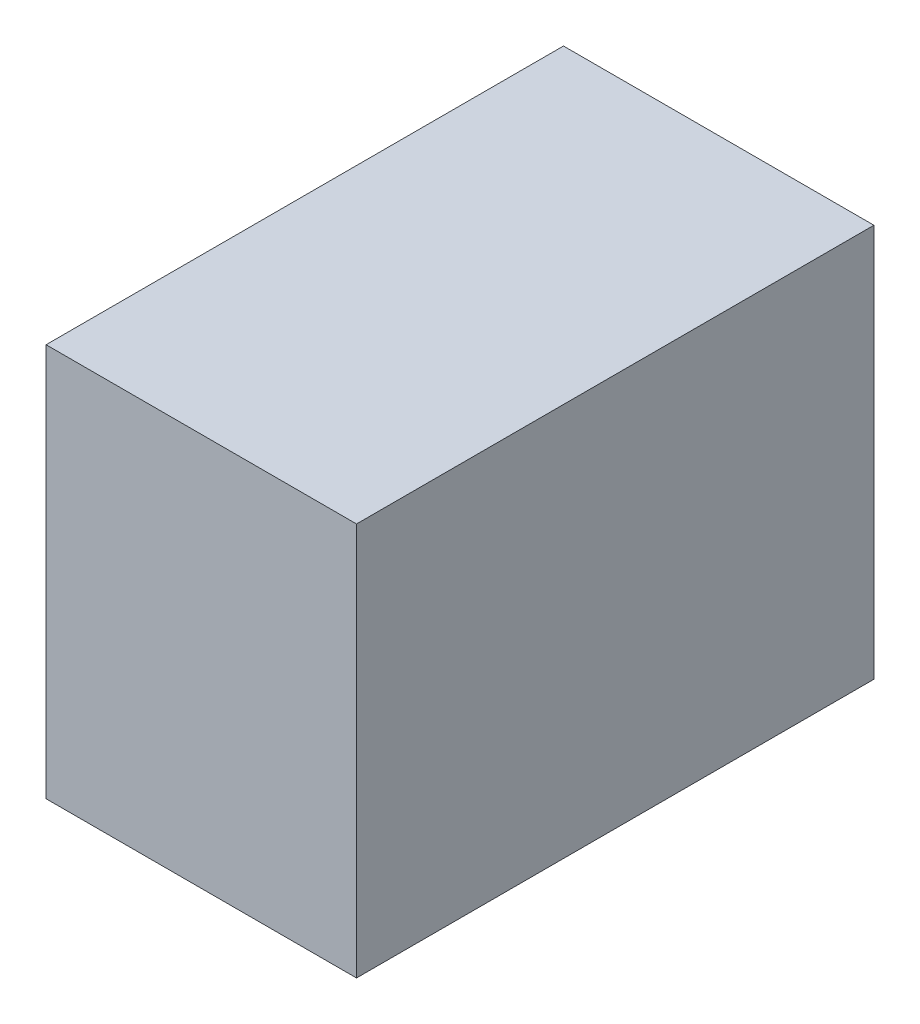
ISO-10303-21;
HEADER;
FILE_DESCRIPTION(('STEP AP214'),'2;1');
FILE_NAME('part.step','',(''),(''),'','','');
FILE_SCHEMA(('AUTOMOTIVE_DESIGN { 1 0 10303 214 1 1 1 1 }'));
ENDSEC;
DATA;
#1=APPLICATION_CONTEXT('core data for automotive mechanical design processes');
#2=APPLICATION_PROTOCOL_DEFINITION('international standard','automotive_design',2000,#1);
#3=PRODUCT_CONTEXT('',#1,'mechanical');
#4=PRODUCT('Part','Part','',(#3));
#5=PRODUCT_RELATED_PRODUCT_CATEGORY('part','',(#4));
#6=PRODUCT_DEFINITION_FORMATION('','',#4);
#7=PRODUCT_DEFINITION_CONTEXT('part definition',#1,'design');
#8=PRODUCT_DEFINITION('design','',#6,#7);
#9=PRODUCT_DEFINITION_SHAPE('','',#8);
#10=(LENGTH_UNIT() NAMED_UNIT(*) SI_UNIT(.MILLI.,.METRE.));
#11=(NAMED_UNIT(*) PLANE_ANGLE_UNIT() SI_UNIT($,.RADIAN.));
#12=(NAMED_UNIT(*) SI_UNIT($,.STERADIAN.) SOLID_ANGLE_UNIT());
#13=UNCERTAINTY_MEASURE_WITH_UNIT(LENGTH_MEASURE(1.E-05),#10,'distance_accuracy_value','');
#14=(GEOMETRIC_REPRESENTATION_CONTEXT(3) GLOBAL_UNCERTAINTY_ASSIGNED_CONTEXT((#13)) GLOBAL_UNIT_ASSIGNED_CONTEXT((#10,
#11,#12)) REPRESENTATION_CONTEXT('',''));
#15=CARTESIAN_POINT('',(0.,0.,0.));
#16=DIRECTION('',(0.,0.,1.));
#17=DIRECTION('',(1.,0.,0.));
#18=AXIS2_PLACEMENT_3D('',#15,#16,#17);
#19=CARTESIAN_POINT('',(750.,1900.,1250.));
#20=DIRECTION('',(-1.,0.,0.));
#21=DIRECTION('',(0.,0.,1.));
#22=AXIS2_PLACEMENT_3D('',#19,#20,#21);
#23=PLANE('',#22);
#24=DIRECTION('',(0.,0.,-1.));
#25=VECTOR('',#24,1.);
#26=CARTESIAN_POINT('',(750.,0.,1250.));
#27=LINE('',#26,#25);
#28=CARTESIAN_POINT('',(750.,0.,1250.));
#29=VERTEX_POINT('',#28);
#30=CARTESIAN_POINT('',(750.,0.,-1250.));
#31=VERTEX_POINT('',#30);
#32=EDGE_CURVE('E107',#29,#31,#27,.T.);
#33=ORIENTED_EDGE('',*,*,#32,.T.);
#34=DIRECTION('',(0.,-1.,0.));
#35=VECTOR('',#34,1.);
#36=CARTESIAN_POINT('',(750.,1900.,-1250.));
#37=LINE('',#36,#35);
#38=CARTESIAN_POINT('',(750.,1900.,-1250.));
#39=VERTEX_POINT('',#38);
#40=EDGE_CURVE('E11',#39,#31,#37,.T.);
#41=ORIENTED_EDGE('',*,*,#40,.F.);
#42=DIRECTION('',(0.,0.,-1.));
#43=VECTOR('',#42,1.);
#44=CARTESIAN_POINT('',(750.,1900.,1250.));
#45=LINE('',#44,#43);
#46=CARTESIAN_POINT('',(750.,1900.,1250.));
#47=VERTEX_POINT('',#46);
#48=EDGE_CURVE('E91',#47,#39,#45,.T.);
#49=ORIENTED_EDGE('',*,*,#48,.F.);
#50=DIRECTION('',(0.,-1.,0.));
#51=VECTOR('',#50,1.);
#52=CARTESIAN_POINT('',(750.,1900.,1250.));
#53=LINE('',#52,#51);
#54=EDGE_CURVE('E103',#47,#29,#53,.T.);
#55=ORIENTED_EDGE('',*,*,#54,.T.);
#56=EDGE_LOOP('',(#33,#41,#49,#55));
#57=FACE_BOUND('',#56,.T.);
#58=ADVANCED_FACE('F39',(#57),#23,.F.);
#59=CARTESIAN_POINT('',(-750.,1900.,-1250.));
#60=DIRECTION('',(0.,0.,1.));
#61=DIRECTION('',(1.,0.,0.));
#62=AXIS2_PLACEMENT_3D('',#59,#60,#61);
#63=PLANE('',#62);
#64=DIRECTION('',(-1.,0.,0.));
#65=VECTOR('',#64,1.);
#66=CARTESIAN_POINT('',(-750.,0.,-1250.));
#67=LINE('',#66,#65);
#68=CARTESIAN_POINT('',(-750.,0.,-1250.));
#69=VERTEX_POINT('',#68);
#70=EDGE_CURVE('E96',#31,#69,#67,.T.);
#71=ORIENTED_EDGE('',*,*,#70,.T.);
#72=DIRECTION('',(0.,-1.,0.));
#73=VECTOR('',#72,1.);
#74=CARTESIAN_POINT('',(-750.,1900.,-1250.));
#75=LINE('',#74,#73);
#76=CARTESIAN_POINT('',(-750.,1900.,-1250.));
#77=VERTEX_POINT('',#76);
#78=EDGE_CURVE('E48',#77,#69,#75,.T.);
#79=ORIENTED_EDGE('',*,*,#78,.F.);
#80=DIRECTION('',(-1.,0.,0.));
#81=VECTOR('',#80,1.);
#82=CARTESIAN_POINT('',(-750.,1900.,-1250.));
#83=LINE('',#82,#81);
#84=EDGE_CURVE('E86',#39,#77,#83,.T.);
#85=ORIENTED_EDGE('',*,*,#84,.F.);
#86=ORIENTED_EDGE('',*,*,#40,.T.);
#87=EDGE_LOOP('',(#71,#79,#85,#86));
#88=FACE_BOUND('',#87,.T.);
#89=ADVANCED_FACE('F95',(#88),#63,.F.);
#90=CARTESIAN_POINT('',(-750.,1900.,1250.));
#91=DIRECTION('',(1.,0.,0.));
#92=DIRECTION('',(0.,0.,-1.));
#93=AXIS2_PLACEMENT_3D('',#90,#91,#92);
#94=PLANE('',#93);
#95=DIRECTION('',(0.,0.,1.));
#96=VECTOR('',#95,1.);
#97=CARTESIAN_POINT('',(-750.,0.,1250.));
#98=LINE('',#97,#96);
#99=CARTESIAN_POINT('',(-750.,0.,1250.));
#100=VERTEX_POINT('',#99);
#101=EDGE_CURVE('E73',#69,#100,#98,.T.);
#102=ORIENTED_EDGE('',*,*,#101,.T.);
#103=DIRECTION('',(0.,-1.,0.));
#104=VECTOR('',#103,1.);
#105=CARTESIAN_POINT('',(-750.,1900.,1250.));
#106=LINE('',#105,#104);
#107=CARTESIAN_POINT('',(-750.,1900.,1250.));
#108=VERTEX_POINT('',#107);
#109=EDGE_CURVE('E98',#108,#100,#106,.T.);
#110=ORIENTED_EDGE('',*,*,#109,.F.);
#111=DIRECTION('',(0.,0.,1.));
#112=VECTOR('',#111,1.);
#113=CARTESIAN_POINT('',(-750.,1900.,1250.));
#114=LINE('',#113,#112);
#115=EDGE_CURVE('E89',#77,#108,#114,.T.);
#116=ORIENTED_EDGE('',*,*,#115,.F.);
#117=ORIENTED_EDGE('',*,*,#78,.T.);
#118=EDGE_LOOP('',(#102,#110,#116,#117));
#119=FACE_BOUND('',#118,.T.);
#120=ADVANCED_FACE('F99',(#119),#94,.F.);
#121=CARTESIAN_POINT('',(-750.,1900.,1250.));
#122=DIRECTION('',(0.,0.,-1.));
#123=DIRECTION('',(-1.,0.,0.));
#124=AXIS2_PLACEMENT_3D('',#121,#122,#123);
#125=PLANE('',#124);
#126=DIRECTION('',(1.,0.,0.));
#127=VECTOR('',#126,1.);
#128=CARTESIAN_POINT('',(-750.,0.,1250.));
#129=LINE('',#128,#127);
#130=EDGE_CURVE('E79',#100,#29,#129,.T.);
#131=ORIENTED_EDGE('',*,*,#130,.T.);
#132=ORIENTED_EDGE('',*,*,#54,.F.);
#133=DIRECTION('',(1.,0.,0.));
#134=VECTOR('',#133,1.);
#135=CARTESIAN_POINT('',(-750.,1900.,1250.));
#136=LINE('',#135,#134);
#137=EDGE_CURVE('E56',#108,#47,#136,.T.);
#138=ORIENTED_EDGE('',*,*,#137,.F.);
#139=ORIENTED_EDGE('',*,*,#109,.T.);
#140=EDGE_LOOP('',(#131,#132,#138,#139));
#141=FACE_BOUND('',#140,.T.);
#142=ADVANCED_FACE('F120',(#141),#125,.F.);
#143=CARTESIAN_POINT('',(0.,1900.,0.));
#144=DIRECTION('',(0.,-1.,0.));
#145=DIRECTION('',(0.,0.,-1.));
#146=AXIS2_PLACEMENT_3D('',#143,#144,#145);
#147=PLANE('',#146);
#148=ORIENTED_EDGE('',*,*,#48,.T.);
#149=ORIENTED_EDGE('',*,*,#84,.T.);
#150=ORIENTED_EDGE('',*,*,#115,.T.);
#151=ORIENTED_EDGE('',*,*,#137,.T.);
#152=EDGE_LOOP('',(#148,#149,#150,#151));
#153=FACE_BOUND('',#152,.T.);
#154=ADVANCED_FACE('F87',(#153),#147,.F.);
#155=CARTESIAN_POINT('',(0.,0.,0.));
#156=DIRECTION('',(0.,-1.,0.));
#157=DIRECTION('',(0.,0.,-1.));
#158=AXIS2_PLACEMENT_3D('',#155,#156,#157);
#159=PLANE('',#158);
#160=ORIENTED_EDGE('',*,*,#32,.F.);
#161=ORIENTED_EDGE('',*,*,#130,.F.);
#162=ORIENTED_EDGE('',*,*,#101,.F.);
#163=ORIENTED_EDGE('',*,*,#70,.F.);
#164=EDGE_LOOP('',(#160,#161,#162,#163));
#165=FACE_BOUND('',#164,.T.);
#166=ADVANCED_FACE('F123',(#165),#159,.T.);
#167=CLOSED_SHELL('',(#58,#89,#120,#142,#154,#166));
#168=MANIFOLD_SOLID_BREP('B2',#167);
#169=ADVANCED_BREP_SHAPE_REPRESENTATION('',(#18,#168),#14);
#170=SHAPE_DEFINITION_REPRESENTATION(#9,#169);
ENDSEC;
END-ISO-10303-21;
